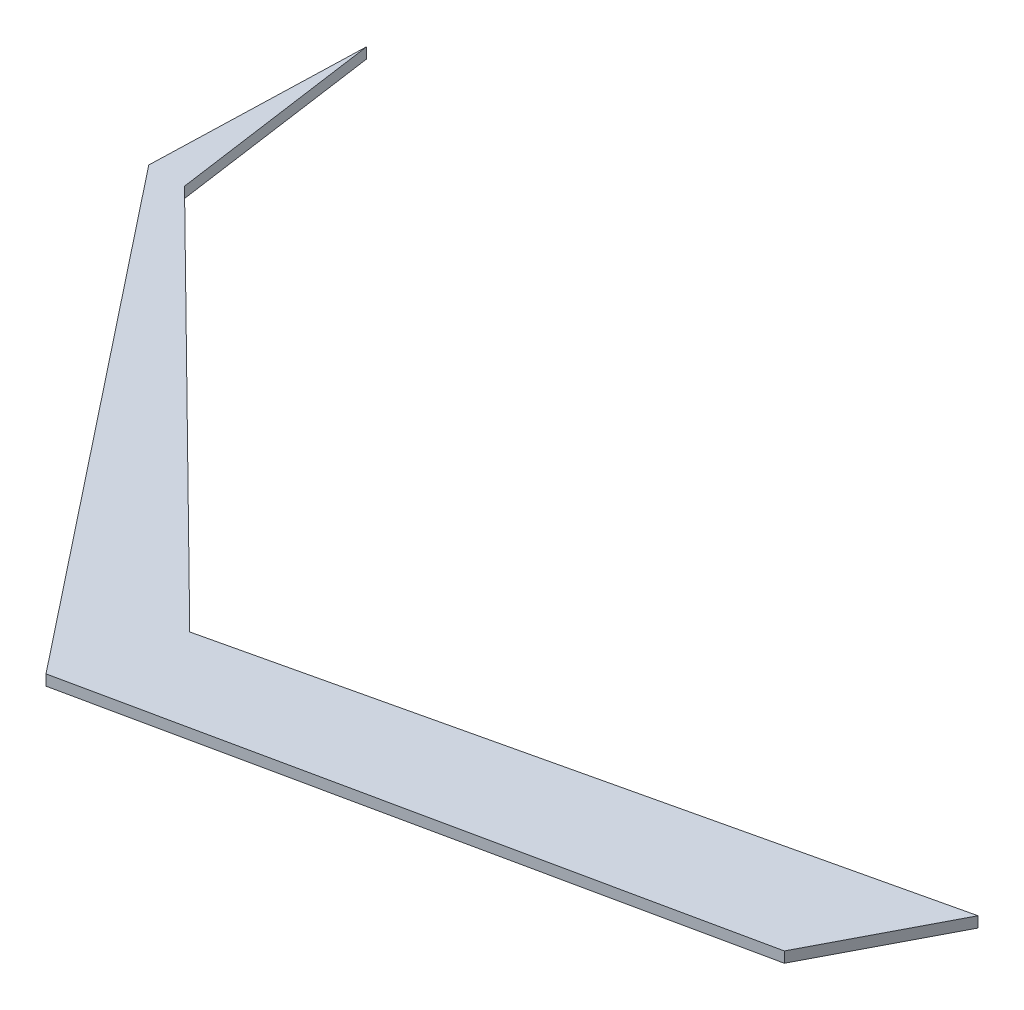
ISO-10303-21;
HEADER;
FILE_DESCRIPTION(('STEP AP214'),'2;1');
FILE_NAME('part.step','',(''),(''),'','','');
FILE_SCHEMA(('AUTOMOTIVE_DESIGN { 1 0 10303 214 1 1 1 1 }'));
ENDSEC;
DATA;
#1=APPLICATION_CONTEXT('core data for automotive mechanical design processes');
#2=APPLICATION_PROTOCOL_DEFINITION('international standard','automotive_design',2000,#1);
#3=PRODUCT_CONTEXT('',#1,'mechanical');
#4=PRODUCT('Part','Part','',(#3));
#5=PRODUCT_RELATED_PRODUCT_CATEGORY('part','',(#4));
#6=PRODUCT_DEFINITION_FORMATION('','',#4);
#7=PRODUCT_DEFINITION_CONTEXT('part definition',#1,'design');
#8=PRODUCT_DEFINITION('design','',#6,#7);
#9=PRODUCT_DEFINITION_SHAPE('','',#8);
#10=(LENGTH_UNIT() NAMED_UNIT(*) SI_UNIT(.MILLI.,.METRE.));
#11=(NAMED_UNIT(*) PLANE_ANGLE_UNIT() SI_UNIT($,.RADIAN.));
#12=(NAMED_UNIT(*) SI_UNIT($,.STERADIAN.) SOLID_ANGLE_UNIT());
#13=UNCERTAINTY_MEASURE_WITH_UNIT(LENGTH_MEASURE(1.E-05),#10,'distance_accuracy_value','');
#14=(GEOMETRIC_REPRESENTATION_CONTEXT(3) GLOBAL_UNCERTAINTY_ASSIGNED_CONTEXT((#13)) GLOBAL_UNIT_ASSIGNED_CONTEXT((#10,
#11,#12)) REPRESENTATION_CONTEXT('',''));
#15=CARTESIAN_POINT('',(0.,0.,0.));
#16=DIRECTION('',(0.,0.,1.));
#17=DIRECTION('',(1.,0.,0.));
#18=AXIS2_PLACEMENT_3D('',#15,#16,#17);
#19=CARTESIAN_POINT('',(-66.1402307500226,2.,-92.083386076109));
#20=DIRECTION('',(-0.99028461517015,0.,0.139055316177801));
#21=DIRECTION('',(0.139055316177801,0.,0.99028461517015));
#22=AXIS2_PLACEMENT_3D('',#19,#20,#21);
#23=PLANE('',#22);
#24=DIRECTION('',(-0.139055316177801,0.,-0.99028461517015));
#25=VECTOR('',#24,1.);
#26=CARTESIAN_POINT('',(-66.1402307500226,0.,-92.083386076109));
#27=LINE('',#26,#25);
#28=CARTESIAN_POINT('',(-66.1402307500226,0.,-92.083386076109));
#29=VERTEX_POINT('',#28);
#30=CARTESIAN_POINT('',(-71.7109344930278,0.,-131.755240155497));
#31=VERTEX_POINT('',#30);
#32=EDGE_CURVE('E134',#29,#31,#27,.T.);
#33=ORIENTED_EDGE('',*,*,#32,.T.);
#34=DIRECTION('',(0.,-1.,0.));
#35=VECTOR('',#34,1.);
#36=CARTESIAN_POINT('',(-71.7109344930278,2.,-131.755240155497));
#37=LINE('',#36,#35);
#38=CARTESIAN_POINT('',(-71.7109344930278,2.,-131.755240155497));
#39=VERTEX_POINT('',#38);
#40=EDGE_CURVE('E11',#39,#31,#37,.T.);
#41=ORIENTED_EDGE('',*,*,#40,.F.);
#42=DIRECTION('',(-0.139055316177801,0.,-0.99028461517015));
#43=VECTOR('',#42,1.);
#44=CARTESIAN_POINT('',(-66.1402307500226,2.,-92.083386076109));
#45=LINE('',#44,#43);
#46=CARTESIAN_POINT('',(-66.1402307500226,2.,-92.083386076109));
#47=VERTEX_POINT('',#46);
#48=EDGE_CURVE('E153',#47,#39,#45,.T.);
#49=ORIENTED_EDGE('',*,*,#48,.F.);
#50=DIRECTION('',(0.,-1.,0.));
#51=VECTOR('',#50,1.);
#52=CARTESIAN_POINT('',(-66.1402307500226,2.,-92.083386076109));
#53=LINE('',#52,#51);
#54=EDGE_CURVE('E130',#47,#29,#53,.T.);
#55=ORIENTED_EDGE('',*,*,#54,.T.);
#56=EDGE_LOOP('',(#33,#41,#49,#55));
#57=FACE_BOUND('',#56,.T.);
#58=ADVANCED_FACE('F39',(#57),#23,.F.);
#59=CARTESIAN_POINT('',(-71.7109344930278,2.,-131.755240155497));
#60=DIRECTION('',(0.99952831096677,0.,0.0307108380855482));
#61=DIRECTION('',(0.0307108380855482,0.,-0.99952831096677));
#62=AXIS2_PLACEMENT_3D('',#59,#60,#61);
#63=PLANE('',#62);
#64=DIRECTION('',(-0.0307108380855482,0.,0.99952831096677));
#65=VECTOR('',#64,1.);
#66=CARTESIAN_POINT('',(-71.7109344930278,0.,-131.755240155497));
#67=LINE('',#66,#65);
#68=CARTESIAN_POINT('',(-72.9270231728523,0.,-92.1758883727544));
#69=VERTEX_POINT('',#68);
#70=EDGE_CURVE('E138',#31,#69,#67,.T.);
#71=ORIENTED_EDGE('',*,*,#70,.T.);
#72=DIRECTION('',(0.,-1.,0.));
#73=VECTOR('',#72,1.);
#74=CARTESIAN_POINT('',(-72.9270231728523,2.,-92.1758883727544));
#75=LINE('',#74,#73);
#76=CARTESIAN_POINT('',(-72.9270231728523,2.,-92.1758883727544));
#77=VERTEX_POINT('',#76);
#78=EDGE_CURVE('E48',#77,#69,#75,.T.);
#79=ORIENTED_EDGE('',*,*,#78,.F.);
#80=DIRECTION('',(-0.0307108380855482,0.,0.99952831096677));
#81=VECTOR('',#80,1.);
#82=CARTESIAN_POINT('',(-71.7109344930278,2.,-131.755240155497));
#83=LINE('',#82,#81);
#84=EDGE_CURVE('E96',#39,#77,#83,.T.);
#85=ORIENTED_EDGE('',*,*,#84,.F.);
#86=ORIENTED_EDGE('',*,*,#40,.T.);
#87=EDGE_LOOP('',(#71,#79,#85,#86));
#88=FACE_BOUND('',#87,.T.);
#89=ADVANCED_FACE('F187',(#88),#63,.F.);
#90=CARTESIAN_POINT('',(-72.9270231728523,2.,-92.1758883727544));
#91=DIRECTION('',(0.78423440968901,0.,-0.620464657059313));
#92=DIRECTION('',(-0.620464657059313,0.,-0.78423440968901));
#93=AXIS2_PLACEMENT_3D('',#90,#91,#92);
#94=PLANE('',#93);
#95=DIRECTION('',(0.620464657059313,0.,0.78423440968901));
#96=VECTOR('',#95,1.);
#97=CARTESIAN_POINT('',(-72.9270231728523,0.,-92.1758883727544));
#98=LINE('',#97,#96);
#99=CARTESIAN_POINT('',(0.,0.,0.));
#100=VERTEX_POINT('',#99);
#101=EDGE_CURVE('E141',#69,#100,#98,.T.);
#102=ORIENTED_EDGE('',*,*,#101,.T.);
#103=DIRECTION('',(0.,-1.,0.));
#104=VECTOR('',#103,1.);
#105=CARTESIAN_POINT('',(0.,2.,0.));
#106=LINE('',#105,#104);
#107=CARTESIAN_POINT('',(0.,2.,0.));
#108=VERTEX_POINT('',#107);
#109=EDGE_CURVE('E160',#108,#100,#106,.T.);
#110=ORIENTED_EDGE('',*,*,#109,.F.);
#111=DIRECTION('',(0.620464657059313,0.,0.78423440968901));
#112=VECTOR('',#111,1.);
#113=CARTESIAN_POINT('',(-72.9270231728523,2.,-92.1758883727544));
#114=LINE('',#113,#112);
#115=EDGE_CURVE('E170',#77,#108,#114,.T.);
#116=ORIENTED_EDGE('',*,*,#115,.F.);
#117=ORIENTED_EDGE('',*,*,#78,.T.);
#118=EDGE_LOOP('',(#102,#110,#116,#117));
#119=FACE_BOUND('',#118,.T.);
#120=ADVANCED_FACE('F168',(#119),#94,.F.);
#121=CARTESIAN_POINT('',(0.,2.,0.));
#122=DIRECTION('',(-0.207509213580713,0.,-0.978233063374528));
#123=DIRECTION('',(-0.978233063374529,0.,0.207509213580713));
#124=AXIS2_PLACEMENT_3D('',#121,#122,#123);
#125=PLANE('',#124);
#126=DIRECTION('',(0.978233063374528,0.,-0.207509213580713));
#127=VECTOR('',#126,1.);
#128=CARTESIAN_POINT('',(0.,0.,0.));
#129=LINE('',#128,#127);
#130=CARTESIAN_POINT('',(114.087295212353,0.,-24.2009453528377));
#131=VERTEX_POINT('',#130);
#132=EDGE_CURVE('E144',#100,#131,#129,.T.);
#133=ORIENTED_EDGE('',*,*,#132,.T.);
#134=DIRECTION('',(0.,-1.,0.));
#135=VECTOR('',#134,1.);
#136=CARTESIAN_POINT('',(114.087295212353,2.,-24.2009453528377));
#137=LINE('',#136,#135);
#138=CARTESIAN_POINT('',(114.087295212353,2.,-24.2009453528377));
#139=VERTEX_POINT('',#138);
#140=EDGE_CURVE('E123',#139,#131,#137,.T.);
#141=ORIENTED_EDGE('',*,*,#140,.F.);
#142=DIRECTION('',(0.978233063374528,0.,-0.207509213580713));
#143=VECTOR('',#142,1.);
#144=CARTESIAN_POINT('',(0.,2.,0.));
#145=LINE('',#144,#143);
#146=EDGE_CURVE('E112',#108,#139,#145,.T.);
#147=ORIENTED_EDGE('',*,*,#146,.F.);
#148=ORIENTED_EDGE('',*,*,#109,.T.);
#149=EDGE_LOOP('',(#133,#141,#147,#148));
#150=FACE_BOUND('',#149,.T.);
#151=ADVANCED_FACE('F176',(#150),#125,.F.);
#152=CARTESIAN_POINT('',(114.087295212353,2.,-24.2009453528377));
#153=DIRECTION('',(-0.886763901981046,0.,-0.462222654294822));
#154=DIRECTION('',(-0.462222654294822,0.,0.886763901981046));
#155=AXIS2_PLACEMENT_3D('',#152,#153,#154);
#156=PLANE('',#155);
#157=DIRECTION('',(0.462222654294822,0.,-0.886763901981046));
#158=VECTOR('',#157,1.);
#159=CARTESIAN_POINT('',(114.087295212353,0.,-24.2009453528377));
#160=LINE('',#159,#158);
#161=CARTESIAN_POINT('',(126.521168393326,0.,-48.055055047047));
#162=VERTEX_POINT('',#161);
#163=EDGE_CURVE('E121',#131,#162,#160,.T.);
#164=ORIENTED_EDGE('',*,*,#163,.T.);
#165=DIRECTION('',(0.,-1.,0.));
#166=VECTOR('',#165,1.);
#167=CARTESIAN_POINT('',(126.521168393326,2.,-48.055055047047));
#168=LINE('',#167,#166);
#169=CARTESIAN_POINT('',(126.521168393326,2.,-48.055055047047));
#170=VERTEX_POINT('',#169);
#171=EDGE_CURVE('E118',#170,#162,#168,.T.);
#172=ORIENTED_EDGE('',*,*,#171,.F.);
#173=DIRECTION('',(0.462222654294822,0.,-0.886763901981046));
#174=VECTOR('',#173,1.);
#175=CARTESIAN_POINT('',(114.087295212353,2.,-24.2009453528377));
#176=LINE('',#175,#174);
#177=EDGE_CURVE('E106',#139,#170,#176,.T.);
#178=ORIENTED_EDGE('',*,*,#177,.F.);
#179=ORIENTED_EDGE('',*,*,#140,.T.);
#180=EDGE_LOOP('',(#164,#172,#178,#179));
#181=FACE_BOUND('',#180,.T.);
#182=ADVANCED_FACE('F119',(#181),#156,.F.);
#183=CARTESIAN_POINT('',(126.521168393326,2.,-48.055055047047));
#184=DIRECTION('',(0.225876956920802,0.,0.974155839859413));
#185=DIRECTION('',(0.974155839859413,0.,-0.225876956920802));
#186=AXIS2_PLACEMENT_3D('',#183,#184,#185);
#187=PLANE('',#186);
#188=DIRECTION('',(-0.974155839859413,0.,0.225876956920802));
#189=VECTOR('',#188,1.);
#190=CARTESIAN_POINT('',(126.521168393326,0.,-48.055055047047));
#191=LINE('',#190,#189);
#192=CARTESIAN_POINT('',(6.66275658484207,0.,-20.2635537154244));
#193=VERTEX_POINT('',#192);
#194=EDGE_CURVE('E82',#162,#193,#191,.T.);
#195=ORIENTED_EDGE('',*,*,#194,.T.);
#196=DIRECTION('',(0.,-1.,0.));
#197=VECTOR('',#196,1.);
#198=CARTESIAN_POINT('',(6.66275658484207,2.,-20.2635537154244));
#199=LINE('',#198,#197);
#200=CARTESIAN_POINT('',(6.66275658484207,2.,-20.2635537154244));
#201=VERTEX_POINT('',#200);
#202=EDGE_CURVE('E124',#201,#193,#199,.T.);
#203=ORIENTED_EDGE('',*,*,#202,.F.);
#204=DIRECTION('',(-0.974155839859413,0.,0.225876956920802));
#205=VECTOR('',#204,1.);
#206=CARTESIAN_POINT('',(126.521168393326,2.,-48.055055047047));
#207=LINE('',#206,#205);
#208=EDGE_CURVE('E110',#170,#201,#207,.T.);
#209=ORIENTED_EDGE('',*,*,#208,.F.);
#210=ORIENTED_EDGE('',*,*,#171,.T.);
#211=EDGE_LOOP('',(#195,#203,#209,#210));
#212=FACE_BOUND('',#211,.T.);
#213=ADVANCED_FACE('F126',(#212),#187,.F.);
#214=CARTESIAN_POINT('',(6.66275658484207,2.,-20.2635537154244));
#215=DIRECTION('',(-0.702283597701559,0.,0.711897287815703));
#216=DIRECTION('',(0.711897287815703,0.,0.702283597701559));
#217=AXIS2_PLACEMENT_3D('',#214,#215,#216);
#218=PLANE('',#217);
#219=DIRECTION('',(-0.711897287815703,0.,-0.702283597701559));
#220=VECTOR('',#219,1.);
#221=CARTESIAN_POINT('',(6.66275658484207,0.,-20.2635537154244));
#222=LINE('',#221,#220);
#223=EDGE_CURVE('E88',#193,#29,#222,.T.);
#224=ORIENTED_EDGE('',*,*,#223,.T.);
#225=ORIENTED_EDGE('',*,*,#54,.F.);
#226=DIRECTION('',(-0.711897287815703,0.,-0.702283597701559));
#227=VECTOR('',#226,1.);
#228=CARTESIAN_POINT('',(6.66275658484207,2.,-20.2635537154244));
#229=LINE('',#228,#227);
#230=EDGE_CURVE('E56',#201,#47,#229,.T.);
#231=ORIENTED_EDGE('',*,*,#230,.F.);
#232=ORIENTED_EDGE('',*,*,#202,.T.);
#233=EDGE_LOOP('',(#224,#225,#231,#232));
#234=FACE_BOUND('',#233,.T.);
#235=ADVANCED_FACE('F201',(#234),#218,.F.);
#236=CARTESIAN_POINT('',(0.,2.,0.));
#237=DIRECTION('',(0.,-1.,0.));
#238=DIRECTION('',(0.,0.,-1.));
#239=AXIS2_PLACEMENT_3D('',#236,#237,#238);
#240=PLANE('',#239);
#241=ORIENTED_EDGE('',*,*,#48,.T.);
#242=ORIENTED_EDGE('',*,*,#84,.T.);
#243=ORIENTED_EDGE('',*,*,#115,.T.);
#244=ORIENTED_EDGE('',*,*,#146,.T.);
#245=ORIENTED_EDGE('',*,*,#177,.T.);
#246=ORIENTED_EDGE('',*,*,#208,.T.);
#247=ORIENTED_EDGE('',*,*,#230,.T.);
#248=EDGE_LOOP('',(#241,#242,#243,#244,#245,#246,#247));
#249=FACE_BOUND('',#248,.T.);
#250=ADVANCED_FACE('F108',(#249),#240,.F.);
#251=CARTESIAN_POINT('',(0.,0.,0.));
#252=DIRECTION('',(0.,-1.,0.));
#253=DIRECTION('',(0.,0.,-1.));
#254=AXIS2_PLACEMENT_3D('',#251,#252,#253);
#255=PLANE('',#254);
#256=ORIENTED_EDGE('',*,*,#32,.F.);
#257=ORIENTED_EDGE('',*,*,#223,.F.);
#258=ORIENTED_EDGE('',*,*,#194,.F.);
#259=ORIENTED_EDGE('',*,*,#163,.F.);
#260=ORIENTED_EDGE('',*,*,#132,.F.);
#261=ORIENTED_EDGE('',*,*,#101,.F.);
#262=ORIENTED_EDGE('',*,*,#70,.F.);
#263=EDGE_LOOP('',(#256,#257,#258,#259,#260,#261,#262));
#264=FACE_BOUND('',#263,.T.);
#265=ADVANCED_FACE('F174',(#264),#255,.T.);
#266=CLOSED_SHELL('',(#58,#89,#120,#151,#182,#213,#235,#250,#265));
#267=MANIFOLD_SOLID_BREP('B2',#266);
#268=ADVANCED_BREP_SHAPE_REPRESENTATION('',(#18,#267),#14);
#269=SHAPE_DEFINITION_REPRESENTATION(#9,#268);
ENDSEC;
END-ISO-10303-21;
